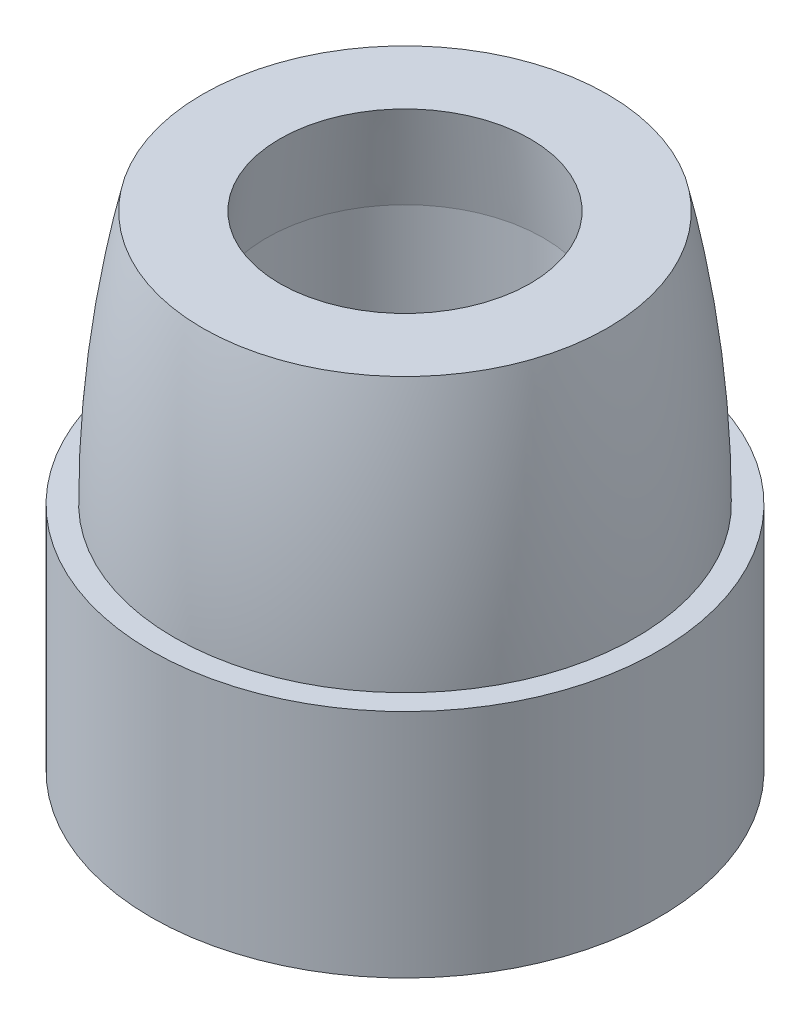
ISO-10303-21;
HEADER;
FILE_DESCRIPTION(('STEP AP214'),'2;1');
FILE_NAME('part.step','',(''),(''),'','','');
FILE_SCHEMA(('AUTOMOTIVE_DESIGN { 1 0 10303 214 1 1 1 1 }'));
ENDSEC;
DATA;
#1=APPLICATION_CONTEXT('core data for automotive mechanical design processes');
#2=APPLICATION_PROTOCOL_DEFINITION('international standard','automotive_design',2000,#1);
#3=PRODUCT_CONTEXT('',#1,'mechanical');
#4=PRODUCT('Part','Part','',(#3));
#5=PRODUCT_RELATED_PRODUCT_CATEGORY('part','',(#4));
#6=PRODUCT_DEFINITION_FORMATION('','',#4);
#7=PRODUCT_DEFINITION_CONTEXT('part definition',#1,'design');
#8=PRODUCT_DEFINITION('design','',#6,#7);
#9=PRODUCT_DEFINITION_SHAPE('','',#8);
#10=(LENGTH_UNIT() NAMED_UNIT(*) SI_UNIT(.MILLI.,.METRE.));
#11=(NAMED_UNIT(*) PLANE_ANGLE_UNIT() SI_UNIT($,.RADIAN.));
#12=(NAMED_UNIT(*) SI_UNIT($,.STERADIAN.) SOLID_ANGLE_UNIT());
#13=UNCERTAINTY_MEASURE_WITH_UNIT(LENGTH_MEASURE(1.E-05),#10,'distance_accuracy_value','');
#14=(GEOMETRIC_REPRESENTATION_CONTEXT(3) GLOBAL_UNCERTAINTY_ASSIGNED_CONTEXT((#13)) GLOBAL_UNIT_ASSIGNED_CONTEXT((#10,
#11,#12)) REPRESENTATION_CONTEXT('',''));
#15=CARTESIAN_POINT('',(0.,0.,0.));
#16=DIRECTION('',(0.,0.,1.));
#17=DIRECTION('',(1.,0.,0.));
#18=AXIS2_PLACEMENT_3D('',#15,#16,#17);
#19=CARTESIAN_POINT('',(0.,5.,0.));
#20=DIRECTION('',(0.,-1.,0.));
#21=DIRECTION('',(0.,0.,-1.));
#22=AXIS2_PLACEMENT_3D('',#19,#20,#21);
#23=DEGENERATE_TOROIDAL_SURFACE('',#22,20.,25.,.F.);
#24=CARTESIAN_POINT('',(0.,5.,0.));
#25=DIRECTION('',(0.,-1.,0.));
#26=DIRECTION('',(0.,0.,-1.));
#27=AXIS2_PLACEMENT_3D('',#24,#25,#26);
#28=CIRCLE('',#27,5.);
#29=CARTESIAN_POINT('',(0.,5.,-5.));
#30=VERTEX_POINT('',#29);
#31=EDGE_CURVE('E40',#30,#30,#28,.T.);
#32=ORIENTED_EDGE('',*,*,#31,.F.);
#33=EDGE_LOOP('',(#32));
#34=FACE_BOUND('',#33,.T.);
#35=CARTESIAN_POINT('',(0.,10.5,0.));
#36=DIRECTION('',(0.,1.,0.));
#37=DIRECTION('',(0.,0.,1.));
#38=AXIS2_PLACEMENT_3D('',#35,#36,#37);
#39=CIRCLE('',#38,4.3874967965144);
#40=CARTESIAN_POINT('',(0.,10.5,4.3874967965144));
#41=VERTEX_POINT('',#40);
#42=EDGE_CURVE('E62',#41,#41,#39,.F.);
#43=ORIENTED_EDGE('',*,*,#42,.T.);
#44=EDGE_LOOP('',(#43));
#45=FACE_BOUND('',#44,.T.);
#46=ADVANCED_FACE('F32',(#34,#45),#23,.F.);
#47=CARTESIAN_POINT('',(0.,12.,0.));
#48=DIRECTION('',(0.,-1.,0.));
#49=DIRECTION('',(0.,0.,-1.));
#50=AXIS2_PLACEMENT_3D('',#47,#48,#49);
#51=CONICAL_SURFACE('',#50,2.5,0.141897054604164);
#52=CARTESIAN_POINT('',(0.,8.5,0.));
#53=DIRECTION('',(0.,-1.,0.));
#54=DIRECTION('',(0.,0.,-1.));
#55=AXIS2_PLACEMENT_3D('',#52,#53,#54);
#56=CIRCLE('',#55,3.);
#57=CARTESIAN_POINT('',(0.,8.5,-3.));
#58=VERTEX_POINT('',#57);
#59=EDGE_CURVE('E45',#58,#58,#56,.T.);
#60=ORIENTED_EDGE('',*,*,#59,.T.);
#61=EDGE_LOOP('',(#60));
#62=FACE_BOUND('',#61,.T.);
#63=CARTESIAN_POINT('',(0.,10.5,0.));
#64=DIRECTION('',(0.,1.,0.));
#65=DIRECTION('',(0.,0.,1.));
#66=AXIS2_PLACEMENT_3D('',#63,#64,#65);
#67=CIRCLE('',#66,2.71428571428571);
#68=CARTESIAN_POINT('',(0.,10.5,2.71428571428571));
#69=VERTEX_POINT('',#68);
#70=EDGE_CURVE('E36',#69,#69,#67,.T.);
#71=ORIENTED_EDGE('',*,*,#70,.T.);
#72=EDGE_LOOP('',(#71));
#73=FACE_BOUND('',#72,.T.);
#74=ADVANCED_FACE('F68',(#62,#73),#51,.F.);
#75=CARTESIAN_POINT('',(0.,0.,0.));
#76=DIRECTION('',(0.,-1.,0.));
#77=DIRECTION('',(0.,0.,-1.));
#78=AXIS2_PLACEMENT_3D('',#75,#76,#77);
#79=CYLINDRICAL_SURFACE('',#78,3.);
#80=ORIENTED_EDGE('',*,*,#59,.F.);
#81=EDGE_LOOP('',(#80));
#82=FACE_BOUND('',#81,.T.);
#83=CARTESIAN_POINT('',(0.,4.,0.));
#84=DIRECTION('',(0.,-1.,0.));
#85=DIRECTION('',(0.,0.,-1.));
#86=AXIS2_PLACEMENT_3D('',#83,#84,#85);
#87=CIRCLE('',#86,3.);
#88=CARTESIAN_POINT('',(0.,4.,-3.));
#89=VERTEX_POINT('',#88);
#90=EDGE_CURVE('E48',#89,#89,#87,.T.);
#91=ORIENTED_EDGE('',*,*,#90,.T.);
#92=EDGE_LOOP('',(#91));
#93=FACE_BOUND('',#92,.T.);
#94=ADVANCED_FACE('F71',(#82,#93),#79,.F.);
#95=CARTESIAN_POINT('',(0.,0.,0.));
#96=DIRECTION('',(0.,-1.,0.));
#97=DIRECTION('',(0.,0.,-1.));
#98=AXIS2_PLACEMENT_3D('',#95,#96,#97);
#99=CYLINDRICAL_SURFACE('',#98,5.5);
#100=CARTESIAN_POINT('',(0.,5.,0.));
#101=DIRECTION('',(0.,-1.,0.));
#102=DIRECTION('',(0.,0.,-1.));
#103=AXIS2_PLACEMENT_3D('',#100,#101,#102);
#104=CIRCLE('',#103,5.5);
#105=CARTESIAN_POINT('',(0.,5.,-5.5));
#106=VERTEX_POINT('',#105);
#107=EDGE_CURVE('E10',#106,#106,#104,.T.);
#108=ORIENTED_EDGE('',*,*,#107,.T.);
#109=EDGE_LOOP('',(#108));
#110=FACE_BOUND('',#109,.T.);
#111=CARTESIAN_POINT('',(0.,0.,0.));
#112=DIRECTION('',(0.,-1.,0.));
#113=DIRECTION('',(0.,0.,-1.));
#114=AXIS2_PLACEMENT_3D('',#111,#112,#113);
#115=CIRCLE('',#114,5.5);
#116=CARTESIAN_POINT('',(0.,0.,-5.5));
#117=VERTEX_POINT('',#116);
#118=EDGE_CURVE('E50',#117,#117,#115,.T.);
#119=ORIENTED_EDGE('',*,*,#118,.F.);
#120=EDGE_LOOP('',(#119));
#121=FACE_BOUND('',#120,.T.);
#122=ADVANCED_FACE('F34',(#110,#121),#99,.T.);
#123=CARTESIAN_POINT('',(5.5,5.,0.));
#124=DIRECTION('',(0.,1.,0.));
#125=DIRECTION('',(0.,0.,1.));
#126=AXIS2_PLACEMENT_3D('',#123,#124,#125);
#127=PLANE('',#126);
#128=ORIENTED_EDGE('',*,*,#31,.T.);
#129=EDGE_LOOP('',(#128));
#130=FACE_BOUND('',#129,.T.);
#131=ORIENTED_EDGE('',*,*,#107,.F.);
#132=EDGE_LOOP('',(#131));
#133=FACE_BOUND('',#132,.T.);
#134=ADVANCED_FACE('F78',(#130,#133),#127,.T.);
#135=CARTESIAN_POINT('',(3.,0.,0.));
#136=DIRECTION('',(0.,-1.,0.));
#137=DIRECTION('',(0.,0.,-1.));
#138=AXIS2_PLACEMENT_3D('',#135,#136,#137);
#139=PLANE('',#138);
#140=CARTESIAN_POINT('',(0.,0.,0.));
#141=DIRECTION('',(0.,-1.,0.));
#142=DIRECTION('',(0.,0.,-1.));
#143=AXIS2_PLACEMENT_3D('',#140,#141,#142);
#144=CIRCLE('',#143,4.);
#145=CARTESIAN_POINT('',(0.,0.,-4.));
#146=VERTEX_POINT('',#145);
#147=EDGE_CURVE('E57',#146,#146,#144,.T.);
#148=ORIENTED_EDGE('',*,*,#147,.F.);
#149=EDGE_LOOP('',(#148));
#150=FACE_BOUND('',#149,.T.);
#151=ORIENTED_EDGE('',*,*,#118,.T.);
#152=EDGE_LOOP('',(#151));
#153=FACE_BOUND('',#152,.T.);
#154=ADVANCED_FACE('F89',(#150,#153),#139,.T.);
#155=CARTESIAN_POINT('',(0.,4.,0.));
#156=DIRECTION('',(0.,-1.,0.));
#157=DIRECTION('',(0.,0.,-1.));
#158=AXIS2_PLACEMENT_3D('',#155,#156,#157);
#159=CYLINDRICAL_SURFACE('',#158,4.);
#160=CARTESIAN_POINT('',(0.,4.,0.));
#161=DIRECTION('',(0.,-1.,0.));
#162=DIRECTION('',(0.,0.,-1.));
#163=AXIS2_PLACEMENT_3D('',#160,#161,#162);
#164=CIRCLE('',#163,4.);
#165=CARTESIAN_POINT('',(0.,4.,-4.));
#166=VERTEX_POINT('',#165);
#167=EDGE_CURVE('E51',#166,#166,#164,.T.);
#168=ORIENTED_EDGE('',*,*,#167,.F.);
#169=EDGE_LOOP('',(#168));
#170=FACE_BOUND('',#169,.T.);
#171=ORIENTED_EDGE('',*,*,#147,.T.);
#172=EDGE_LOOP('',(#171));
#173=FACE_BOUND('',#172,.T.);
#174=ADVANCED_FACE('F94',(#170,#173),#159,.F.);
#175=CARTESIAN_POINT('',(0.,4.,0.));
#176=DIRECTION('',(0.,-1.,0.));
#177=DIRECTION('',(0.,0.,-1.));
#178=AXIS2_PLACEMENT_3D('',#175,#176,#177);
#179=PLANE('',#178);
#180=ORIENTED_EDGE('',*,*,#90,.F.);
#181=EDGE_LOOP('',(#180));
#182=FACE_BOUND('',#181,.T.);
#183=ORIENTED_EDGE('',*,*,#167,.T.);
#184=EDGE_LOOP('',(#183));
#185=FACE_BOUND('',#184,.T.);
#186=ADVANCED_FACE('F100',(#182,#185),#179,.T.);
#187=CARTESIAN_POINT('',(0.,10.5,0.));
#188=DIRECTION('',(0.,1.,0.));
#189=DIRECTION('',(0.,0.,1.));
#190=AXIS2_PLACEMENT_3D('',#187,#188,#189);
#191=PLANE('',#190);
#192=ORIENTED_EDGE('',*,*,#42,.F.);
#193=EDGE_LOOP('',(#192));
#194=FACE_BOUND('',#193,.T.);
#195=ORIENTED_EDGE('',*,*,#70,.F.);
#196=EDGE_LOOP('',(#195));
#197=FACE_BOUND('',#196,.T.);
#198=ADVANCED_FACE('F108',(#194,#197),#191,.T.);
#199=CLOSED_SHELL('',(#46,#74,#94,#122,#134,#154,#174,#186,#198));
#200=MANIFOLD_SOLID_BREP('B2',#199);
#201=ADVANCED_BREP_SHAPE_REPRESENTATION('',(#18,#200),#14);
#202=SHAPE_DEFINITION_REPRESENTATION(#9,#201);
ENDSEC;
END-ISO-10303-21;
